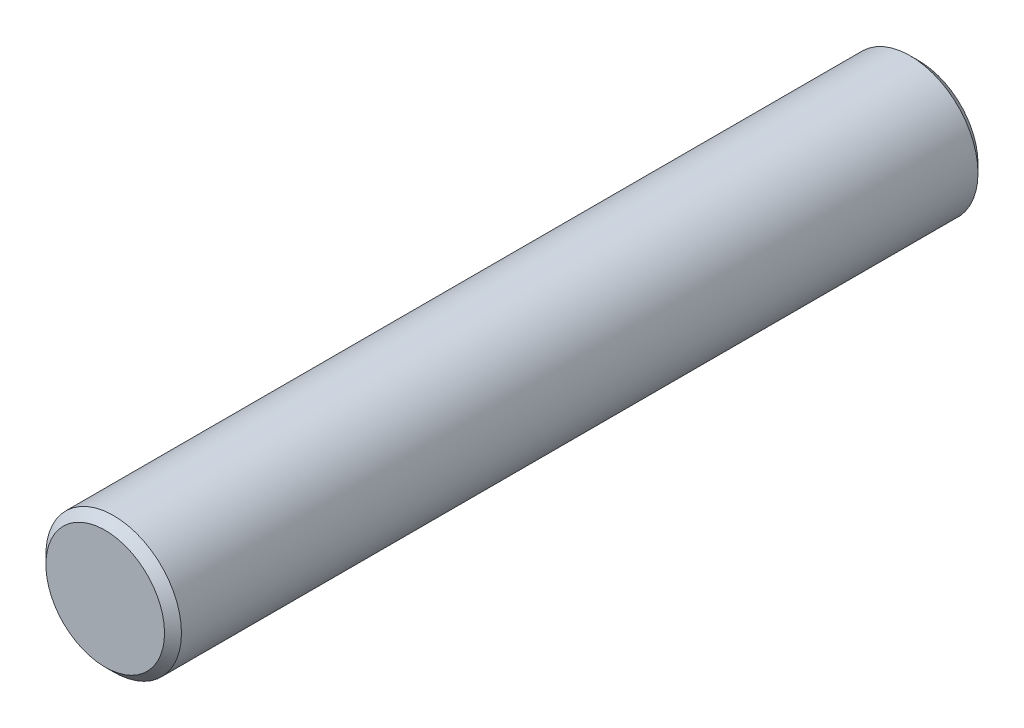
ISO-10303-21;
HEADER;
FILE_DESCRIPTION(('STEP AP214'),'2;1');
FILE_NAME('part.step','',(''),(''),'','','');
FILE_SCHEMA(('AUTOMOTIVE_DESIGN { 1 0 10303 214 1 1 1 1 }'));
ENDSEC;
DATA;
#1=APPLICATION_CONTEXT('core data for automotive mechanical design processes');
#2=APPLICATION_PROTOCOL_DEFINITION('international standard','automotive_design',2000,#1);
#3=PRODUCT_CONTEXT('',#1,'mechanical');
#4=PRODUCT('Part','Part','',(#3));
#5=PRODUCT_RELATED_PRODUCT_CATEGORY('part','',(#4));
#6=PRODUCT_DEFINITION_FORMATION('','',#4);
#7=PRODUCT_DEFINITION_CONTEXT('part definition',#1,'design');
#8=PRODUCT_DEFINITION('design','',#6,#7);
#9=PRODUCT_DEFINITION_SHAPE('','',#8);
#10=(LENGTH_UNIT() NAMED_UNIT(*) SI_UNIT(.MILLI.,.METRE.));
#11=(NAMED_UNIT(*) PLANE_ANGLE_UNIT() SI_UNIT($,.RADIAN.));
#12=(NAMED_UNIT(*) SI_UNIT($,.STERADIAN.) SOLID_ANGLE_UNIT());
#13=UNCERTAINTY_MEASURE_WITH_UNIT(LENGTH_MEASURE(1.E-05),#10,'distance_accuracy_value','');
#14=(GEOMETRIC_REPRESENTATION_CONTEXT(3) GLOBAL_UNCERTAINTY_ASSIGNED_CONTEXT((#13)) GLOBAL_UNIT_ASSIGNED_CONTEXT((#10,
#11,#12)) REPRESENTATION_CONTEXT('',''));
#15=CARTESIAN_POINT('',(0.,0.,0.));
#16=DIRECTION('',(0.,0.,1.));
#17=DIRECTION('',(1.,0.,0.));
#18=AXIS2_PLACEMENT_3D('',#15,#16,#17);
#19=CARTESIAN_POINT('',(0.,0.,48.));
#20=DIRECTION('',(0.,0.,-1.));
#21=DIRECTION('',(-1.,0.,0.));
#22=AXIS2_PLACEMENT_3D('',#19,#20,#21);
#23=CYLINDRICAL_SURFACE('',#22,8.);
#24=CARTESIAN_POINT('',(0.,0.,-47.));
#25=DIRECTION('',(0.,0.,1.));
#26=DIRECTION('',(1.,0.,0.));
#27=AXIS2_PLACEMENT_3D('',#24,#25,#26);
#28=CIRCLE('',#27,8.);
#29=CARTESIAN_POINT('',(8.,0.,-47.));
#30=VERTEX_POINT('',#29);
#31=EDGE_CURVE('E50',#30,#30,#28,.T.);
#32=ORIENTED_EDGE('',*,*,#31,.T.);
#33=EDGE_LOOP('',(#32));
#34=FACE_BOUND('',#33,.T.);
#35=CARTESIAN_POINT('',(0.,0.,47.));
#36=DIRECTION('',(0.,0.,1.));
#37=DIRECTION('',(1.,0.,0.));
#38=AXIS2_PLACEMENT_3D('',#35,#36,#37);
#39=CIRCLE('',#38,8.);
#40=CARTESIAN_POINT('',(8.,0.,47.));
#41=VERTEX_POINT('',#40);
#42=EDGE_CURVE('E55',#41,#41,#39,.F.);
#43=ORIENTED_EDGE('',*,*,#42,.T.);
#44=EDGE_LOOP('',(#43));
#45=FACE_BOUND('',#44,.T.);
#46=ADVANCED_FACE('F37',(#34,#45),#23,.T.);
#47=CARTESIAN_POINT('',(0.,0.,48.));
#48=DIRECTION('',(0.,0.,1.));
#49=DIRECTION('',(1.,0.,0.));
#50=AXIS2_PLACEMENT_3D('',#47,#48,#49);
#51=PLANE('',#50);
#52=CARTESIAN_POINT('',(0.,0.,48.));
#53=DIRECTION('',(0.,0.,1.));
#54=DIRECTION('',(1.,0.,0.));
#55=AXIS2_PLACEMENT_3D('',#52,#53,#54);
#56=CIRCLE('',#55,6.99999999999999);
#57=CARTESIAN_POINT('',(6.99999999999999,0.,48.));
#58=VERTEX_POINT('',#57);
#59=EDGE_CURVE('E10',#58,#58,#56,.T.);
#60=ORIENTED_EDGE('',*,*,#59,.T.);
#61=EDGE_LOOP('',(#60));
#62=FACE_BOUND('',#61,.T.);
#63=ADVANCED_FACE('F72',(#62),#51,.T.);
#64=CARTESIAN_POINT('',(0.,0.,-48.));
#65=DIRECTION('',(0.,0.,1.));
#66=DIRECTION('',(1.,0.,0.));
#67=AXIS2_PLACEMENT_3D('',#64,#65,#66);
#68=PLANE('',#67);
#69=CARTESIAN_POINT('',(0.,0.,-48.));
#70=DIRECTION('',(0.,0.,1.));
#71=DIRECTION('',(1.,0.,0.));
#72=AXIS2_PLACEMENT_3D('',#69,#70,#71);
#73=CIRCLE('',#72,7.00000000000001);
#74=CARTESIAN_POINT('',(7.00000000000001,0.,-48.));
#75=VERTEX_POINT('',#74);
#76=EDGE_CURVE('E45',#75,#75,#73,.F.);
#77=ORIENTED_EDGE('',*,*,#76,.T.);
#78=EDGE_LOOP('',(#77));
#79=FACE_BOUND('',#78,.T.);
#80=ADVANCED_FACE('F69',(#79),#68,.F.);
#81=CARTESIAN_POINT('',(0.,0.,-47.));
#82=DIRECTION('',(0.,0.,1.));
#83=DIRECTION('',(1.,0.,0.));
#84=AXIS2_PLACEMENT_3D('',#81,#82,#83);
#85=CONICAL_SURFACE('',#84,8.,0.785398163397459);
#86=ORIENTED_EDGE('',*,*,#76,.F.);
#87=EDGE_LOOP('',(#86));
#88=FACE_BOUND('',#87,.T.);
#89=ORIENTED_EDGE('',*,*,#31,.F.);
#90=EDGE_LOOP('',(#89));
#91=FACE_BOUND('',#90,.T.);
#92=ADVANCED_FACE('F65',(#88,#91),#85,.T.);
#93=CARTESIAN_POINT('',(0.,0.,48.));
#94=DIRECTION('',(0.,0.,-1.));
#95=DIRECTION('',(-1.,0.,0.));
#96=AXIS2_PLACEMENT_3D('',#93,#94,#95);
#97=CONICAL_SURFACE('',#96,6.99999999999999,0.785398163397441);
#98=ORIENTED_EDGE('',*,*,#42,.F.);
#99=EDGE_LOOP('',(#98));
#100=FACE_BOUND('',#99,.T.);
#101=ORIENTED_EDGE('',*,*,#59,.F.);
#102=EDGE_LOOP('',(#101));
#103=FACE_BOUND('',#102,.T.);
#104=ADVANCED_FACE('F39',(#100,#103),#97,.T.);
#105=CLOSED_SHELL('',(#46,#63,#80,#92,#104));
#106=MANIFOLD_SOLID_BREP('B2',#105);
#107=ADVANCED_BREP_SHAPE_REPRESENTATION('',(#18,#106),#14);
#108=SHAPE_DEFINITION_REPRESENTATION(#9,#107);
ENDSEC;
END-ISO-10303-21;
